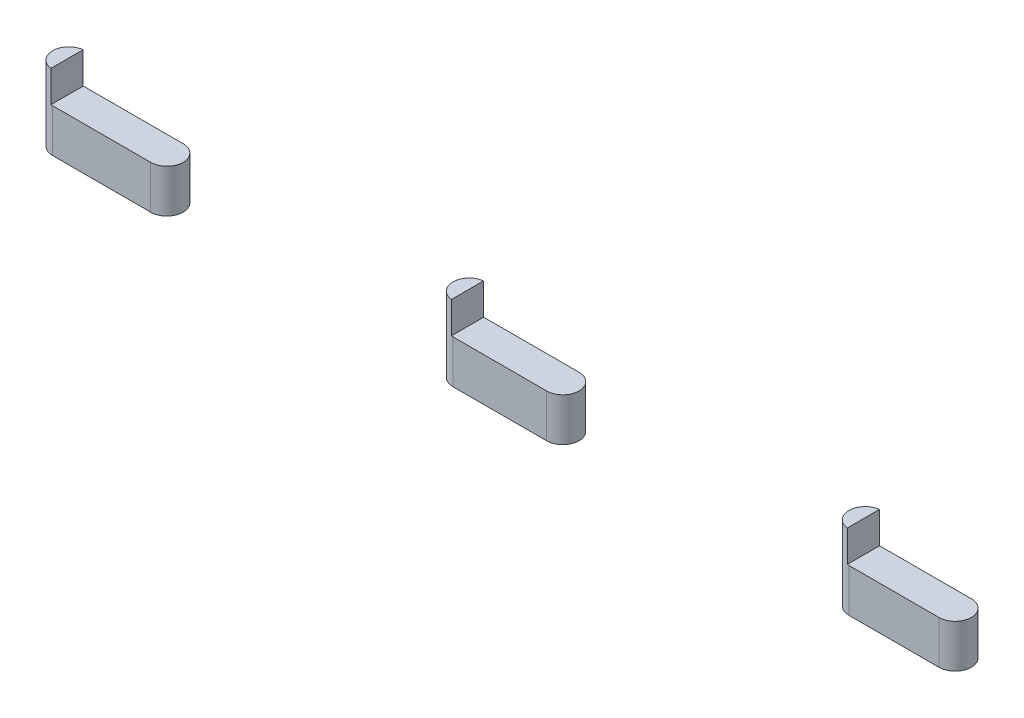
ISO-10303-21;
HEADER;
FILE_DESCRIPTION(('STEP AP214'),'2;1');
FILE_NAME('part.step','',(''),(''),'','','');
FILE_SCHEMA(('AUTOMOTIVE_DESIGN { 1 0 10303 214 1 1 1 1 }'));
ENDSEC;
DATA;
#1=APPLICATION_CONTEXT('core data for automotive mechanical design processes');
#2=APPLICATION_PROTOCOL_DEFINITION('international standard','automotive_design',2000,#1);
#3=PRODUCT_CONTEXT('',#1,'mechanical');
#4=PRODUCT('Part','Part','',(#3));
#5=PRODUCT_RELATED_PRODUCT_CATEGORY('part','',(#4));
#6=PRODUCT_DEFINITION_FORMATION('','',#4);
#7=PRODUCT_DEFINITION_CONTEXT('part definition',#1,'design');
#8=PRODUCT_DEFINITION('design','',#6,#7);
#9=PRODUCT_DEFINITION_SHAPE('','',#8);
#10=(LENGTH_UNIT() NAMED_UNIT(*) SI_UNIT(.MILLI.,.METRE.));
#11=(NAMED_UNIT(*) PLANE_ANGLE_UNIT() SI_UNIT($,.RADIAN.));
#12=(NAMED_UNIT(*) SI_UNIT($,.STERADIAN.) SOLID_ANGLE_UNIT());
#13=UNCERTAINTY_MEASURE_WITH_UNIT(LENGTH_MEASURE(1.E-05),#10,'distance_accuracy_value','');
#14=(GEOMETRIC_REPRESENTATION_CONTEXT(3) GLOBAL_UNCERTAINTY_ASSIGNED_CONTEXT((#13)) GLOBAL_UNIT_ASSIGNED_CONTEXT((#10,
#11,#12)) REPRESENTATION_CONTEXT('',''));
#15=CARTESIAN_POINT('',(0.,0.,0.));
#16=DIRECTION('',(0.,0.,1.));
#17=DIRECTION('',(1.,0.,0.));
#18=AXIS2_PLACEMENT_3D('',#15,#16,#17);
#19=CARTESIAN_POINT('',(48.8,0.,0.));
#20=DIRECTION('',(0.,-1.,0.));
#21=DIRECTION('',(0.,0.,-1.));
#22=AXIS2_PLACEMENT_3D('',#19,#20,#21);
#23=CYLINDRICAL_SURFACE('',#22,1.8);
#24=DIRECTION('',(0.,1.,0.));
#25=VECTOR('',#24,1.);
#26=CARTESIAN_POINT('',(48.8,0.,1.8));
#27=LINE('',#26,#25);
#28=CARTESIAN_POINT('',(48.8,0.,1.8));
#29=VERTEX_POINT('',#28);
#30=CARTESIAN_POINT('',(48.8,4.8,1.8));
#31=VERTEX_POINT('',#30);
#32=EDGE_CURVE('E113',#29,#31,#27,.T.);
#33=ORIENTED_EDGE('',*,*,#32,.F.);
#34=CARTESIAN_POINT('',(48.8,0.,0.));
#35=DIRECTION('',(0.,1.,0.));
#36=DIRECTION('',(0.,0.,1.));
#37=AXIS2_PLACEMENT_3D('',#34,#35,#36);
#38=CIRCLE('',#37,1.8);
#39=CARTESIAN_POINT('',(48.8,0.,-1.8));
#40=VERTEX_POINT('',#39);
#41=EDGE_CURVE('E58',#40,#29,#38,.F.);
#42=ORIENTED_EDGE('',*,*,#41,.F.);
#43=DIRECTION('',(0.,-1.,0.));
#44=VECTOR('',#43,1.);
#45=CARTESIAN_POINT('',(48.8,4.8,-1.8));
#46=LINE('',#45,#44);
#47=CARTESIAN_POINT('',(48.8,4.8,-1.8));
#48=VERTEX_POINT('',#47);
#49=EDGE_CURVE('E147',#48,#40,#46,.T.);
#50=ORIENTED_EDGE('',*,*,#49,.F.);
#51=CARTESIAN_POINT('',(48.8,4.8,0.));
#52=DIRECTION('',(0.,1.,0.));
#53=DIRECTION('',(0.,0.,1.));
#54=AXIS2_PLACEMENT_3D('',#51,#52,#53);
#55=CIRCLE('',#54,1.8);
#56=EDGE_CURVE('E12',#31,#48,#55,.T.);
#57=ORIENTED_EDGE('',*,*,#56,.F.);
#58=EDGE_LOOP('',(#33,#42,#50,#57));
#59=FACE_BOUND('',#58,.T.);
#60=ADVANCED_FACE('F50',(#59),#23,.T.);
#61=CARTESIAN_POINT('',(38.8,4.8,0.));
#62=DIRECTION('',(0.,-1.,0.));
#63=DIRECTION('',(0.,0.,-1.));
#64=AXIS2_PLACEMENT_3D('',#61,#62,#63);
#65=CYLINDRICAL_SURFACE('',#64,1.8);
#66=DIRECTION('',(0.,-1.,0.));
#67=VECTOR('',#66,1.);
#68=CARTESIAN_POINT('',(38.8,4.8,1.8));
#69=LINE('',#68,#67);
#70=CARTESIAN_POINT('',(38.8,4.8,1.8));
#71=VERTEX_POINT('',#70);
#72=CARTESIAN_POINT('',(38.8,0.,1.8));
#73=VERTEX_POINT('',#72);
#74=EDGE_CURVE('E105',#71,#73,#69,.T.);
#75=ORIENTED_EDGE('',*,*,#74,.F.);
#76=CARTESIAN_POINT('',(38.8,4.8,0.));
#77=DIRECTION('',(0.,1.,0.));
#78=DIRECTION('',(0.,0.,1.));
#79=AXIS2_PLACEMENT_3D('',#76,#77,#78);
#80=CIRCLE('',#79,1.8);
#81=CARTESIAN_POINT('',(38.6,4.8,1.78885438199983));
#82=VERTEX_POINT('',#81);
#83=EDGE_CURVE('E135',#82,#71,#80,.T.);
#84=ORIENTED_EDGE('',*,*,#83,.F.);
#85=DIRECTION('',(0.,-1.,0.));
#86=VECTOR('',#85,1.);
#87=CARTESIAN_POINT('',(38.6,4.8,1.78885438199983));
#88=LINE('',#87,#86);
#89=CARTESIAN_POINT('',(38.6,8.3,1.78885438199983));
#90=VERTEX_POINT('',#89);
#91=EDGE_CURVE('E140',#90,#82,#88,.T.);
#92=ORIENTED_EDGE('',*,*,#91,.F.);
#93=CARTESIAN_POINT('',(38.8,8.3,0.));
#94=DIRECTION('',(0.,1.,0.));
#95=DIRECTION('',(0.,0.,1.));
#96=AXIS2_PLACEMENT_3D('',#93,#94,#95);
#97=CIRCLE('',#96,1.8);
#98=CARTESIAN_POINT('',(38.6,8.3,-1.78885438199983));
#99=VERTEX_POINT('',#98);
#100=EDGE_CURVE('E114',#99,#90,#97,.T.);
#101=ORIENTED_EDGE('',*,*,#100,.F.);
#102=DIRECTION('',(0.,-1.,0.));
#103=VECTOR('',#102,1.);
#104=CARTESIAN_POINT('',(38.6,4.8,-1.78885438199983));
#105=LINE('',#104,#103);
#106=CARTESIAN_POINT('',(38.6,4.8,-1.78885438199983));
#107=VERTEX_POINT('',#106);
#108=EDGE_CURVE('E142',#107,#99,#105,.F.);
#109=ORIENTED_EDGE('',*,*,#108,.F.);
#110=CARTESIAN_POINT('',(38.8,4.8,0.));
#111=DIRECTION('',(0.,1.,0.));
#112=DIRECTION('',(0.,0.,1.));
#113=AXIS2_PLACEMENT_3D('',#110,#111,#112);
#114=CIRCLE('',#113,1.8);
#115=CARTESIAN_POINT('',(38.8,4.8,-1.8));
#116=VERTEX_POINT('',#115);
#117=EDGE_CURVE('E137',#116,#107,#114,.T.);
#118=ORIENTED_EDGE('',*,*,#117,.F.);
#119=DIRECTION('',(0.,1.,0.));
#120=VECTOR('',#119,1.);
#121=CARTESIAN_POINT('',(38.8,4.8,-1.8));
#122=LINE('',#121,#120);
#123=CARTESIAN_POINT('',(38.8,0.,-1.8));
#124=VERTEX_POINT('',#123);
#125=EDGE_CURVE('E108',#124,#116,#122,.T.);
#126=ORIENTED_EDGE('',*,*,#125,.F.);
#127=CARTESIAN_POINT('',(38.8,0.,0.));
#128=DIRECTION('',(0.,1.,0.));
#129=DIRECTION('',(0.,0.,1.));
#130=AXIS2_PLACEMENT_3D('',#127,#128,#129);
#131=CIRCLE('',#130,1.8);
#132=EDGE_CURVE('E101',#73,#124,#131,.F.);
#133=ORIENTED_EDGE('',*,*,#132,.F.);
#134=EDGE_LOOP('',(#75,#84,#92,#101,#109,#118,#126,#133));
#135=FACE_BOUND('',#134,.T.);
#136=ADVANCED_FACE('F103',(#135),#65,.T.);
#137=CARTESIAN_POINT('',(0.,4.8,-1.8));
#138=DIRECTION('',(0.,0.,-1.));
#139=DIRECTION('',(-1.,0.,0.));
#140=AXIS2_PLACEMENT_3D('',#137,#138,#139);
#141=PLANE('',#140);
#142=DIRECTION('',(1.,0.,0.));
#143=VECTOR('',#142,1.);
#144=CARTESIAN_POINT('',(0.,4.8,-1.8));
#145=LINE('',#144,#143);
#146=EDGE_CURVE('E124',#116,#48,#145,.T.);
#147=ORIENTED_EDGE('',*,*,#146,.T.);
#148=ORIENTED_EDGE('',*,*,#49,.T.);
#149=DIRECTION('',(1.,0.,0.));
#150=VECTOR('',#149,1.);
#151=CARTESIAN_POINT('',(0.,0.,-1.8));
#152=LINE('',#151,#150);
#153=EDGE_CURVE('E125',#124,#40,#152,.T.);
#154=ORIENTED_EDGE('',*,*,#153,.F.);
#155=ORIENTED_EDGE('',*,*,#125,.T.);
#156=EDGE_LOOP('',(#147,#148,#154,#155));
#157=FACE_BOUND('',#156,.T.);
#158=ADVANCED_FACE('F149',(#157),#141,.T.);
#159=CARTESIAN_POINT('',(0.,4.8,1.8));
#160=DIRECTION('',(0.,0.,-1.));
#161=DIRECTION('',(-1.,0.,0.));
#162=AXIS2_PLACEMENT_3D('',#159,#160,#161);
#163=PLANE('',#162);
#164=DIRECTION('',(1.,0.,0.));
#165=VECTOR('',#164,1.);
#166=CARTESIAN_POINT('',(0.,0.,1.8));
#167=LINE('',#166,#165);
#168=EDGE_CURVE('E120',#73,#29,#167,.T.);
#169=ORIENTED_EDGE('',*,*,#168,.T.);
#170=ORIENTED_EDGE('',*,*,#32,.T.);
#171=DIRECTION('',(1.,0.,0.));
#172=VECTOR('',#171,1.);
#173=CARTESIAN_POINT('',(0.,4.8,1.8));
#174=LINE('',#173,#172);
#175=EDGE_CURVE('E121',#71,#31,#174,.T.);
#176=ORIENTED_EDGE('',*,*,#175,.F.);
#177=ORIENTED_EDGE('',*,*,#74,.T.);
#178=EDGE_LOOP('',(#169,#170,#176,#177));
#179=FACE_BOUND('',#178,.T.);
#180=ADVANCED_FACE('F118',(#179),#163,.F.);
#181=CARTESIAN_POINT('',(0.,4.8,0.));
#182=DIRECTION('',(0.,1.,0.));
#183=DIRECTION('',(0.,0.,1.));
#184=AXIS2_PLACEMENT_3D('',#181,#182,#183);
#185=PLANE('',#184);
#186=ORIENTED_EDGE('',*,*,#175,.T.);
#187=ORIENTED_EDGE('',*,*,#56,.T.);
#188=ORIENTED_EDGE('',*,*,#146,.F.);
#189=ORIENTED_EDGE('',*,*,#117,.T.);
#190=DIRECTION('',(0.,0.,1.));
#191=VECTOR('',#190,1.);
#192=CARTESIAN_POINT('',(38.6,4.8,0.));
#193=LINE('',#192,#191);
#194=EDGE_CURVE('E128',#107,#82,#193,.T.);
#195=ORIENTED_EDGE('',*,*,#194,.T.);
#196=ORIENTED_EDGE('',*,*,#83,.T.);
#197=EDGE_LOOP('',(#186,#187,#188,#189,#195,#196));
#198=FACE_BOUND('',#197,.T.);
#199=ADVANCED_FACE('F150',(#198),#185,.T.);
#200=CARTESIAN_POINT('',(0.,0.,0.));
#201=DIRECTION('',(0.,1.,0.));
#202=DIRECTION('',(0.,0.,1.));
#203=AXIS2_PLACEMENT_3D('',#200,#201,#202);
#204=PLANE('',#203);
#205=ORIENTED_EDGE('',*,*,#153,.T.);
#206=ORIENTED_EDGE('',*,*,#41,.T.);
#207=ORIENTED_EDGE('',*,*,#168,.F.);
#208=ORIENTED_EDGE('',*,*,#132,.T.);
#209=EDGE_LOOP('',(#205,#206,#207,#208));
#210=FACE_BOUND('',#209,.T.);
#211=ADVANCED_FACE('F123',(#210),#204,.F.);
#212=CARTESIAN_POINT('',(38.6,8.3,0.));
#213=DIRECTION('',(1.,0.,0.));
#214=DIRECTION('',(0.,0.,-1.));
#215=AXIS2_PLACEMENT_3D('',#212,#213,#214);
#216=PLANE('',#215);
#217=ORIENTED_EDGE('',*,*,#194,.F.);
#218=ORIENTED_EDGE('',*,*,#108,.T.);
#219=DIRECTION('',(0.,0.,1.));
#220=VECTOR('',#219,1.);
#221=CARTESIAN_POINT('',(38.6,8.3,0.));
#222=LINE('',#221,#220);
#223=EDGE_CURVE('E130',#99,#90,#222,.T.);
#224=ORIENTED_EDGE('',*,*,#223,.T.);
#225=ORIENTED_EDGE('',*,*,#91,.T.);
#226=EDGE_LOOP('',(#217,#218,#224,#225));
#227=FACE_BOUND('',#226,.T.);
#228=ADVANCED_FACE('F158',(#227),#216,.T.);
#229=CARTESIAN_POINT('',(0.,8.3,0.));
#230=DIRECTION('',(0.,1.,0.));
#231=DIRECTION('',(0.,0.,1.));
#232=AXIS2_PLACEMENT_3D('',#229,#230,#231);
#233=PLANE('',#232);
#234=ORIENTED_EDGE('',*,*,#223,.F.);
#235=ORIENTED_EDGE('',*,*,#100,.T.);
#236=EDGE_LOOP('',(#234,#235));
#237=FACE_BOUND('',#236,.T.);
#238=ADVANCED_FACE('F161',(#237),#233,.T.);
#239=CLOSED_SHELL('',(#60,#136,#158,#180,#199,#211,#228,#238));
#240=MANIFOLD_SOLID_BREP('B2',#239);
#241=CARTESIAN_POINT('',(5.2,0.,0.));
#242=DIRECTION('',(0.,-1.,0.));
#243=DIRECTION('',(0.,0.,-1.));
#244=AXIS2_PLACEMENT_3D('',#241,#242,#243);
#245=CYLINDRICAL_SURFACE('',#244,1.8);
#246=DIRECTION('',(0.,1.,0.));
#247=VECTOR('',#246,1.);
#248=CARTESIAN_POINT('',(5.2,0.,1.8));
#249=LINE('',#248,#247);
#250=CARTESIAN_POINT('',(5.2,0.,1.8));
#251=VERTEX_POINT('',#250);
#252=CARTESIAN_POINT('',(5.2,4.8,1.8));
#253=VERTEX_POINT('',#252);
#254=EDGE_CURVE('E334',#251,#253,#249,.T.);
#255=ORIENTED_EDGE('',*,*,#254,.F.);
#256=CARTESIAN_POINT('',(5.2,0.,0.));
#257=DIRECTION('',(0.,1.,0.));
#258=DIRECTION('',(0.,0.,1.));
#259=AXIS2_PLACEMENT_3D('',#256,#257,#258);
#260=CIRCLE('',#259,1.8);
#261=CARTESIAN_POINT('',(5.2,0.,-1.8));
#262=VERTEX_POINT('',#261);
#263=EDGE_CURVE('E279',#262,#251,#260,.F.);
#264=ORIENTED_EDGE('',*,*,#263,.F.);
#265=DIRECTION('',(0.,-1.,0.));
#266=VECTOR('',#265,1.);
#267=CARTESIAN_POINT('',(5.2,4.8,-1.8));
#268=LINE('',#267,#266);
#269=CARTESIAN_POINT('',(5.2,4.8,-1.8));
#270=VERTEX_POINT('',#269);
#271=EDGE_CURVE('E368',#270,#262,#268,.T.);
#272=ORIENTED_EDGE('',*,*,#271,.F.);
#273=CARTESIAN_POINT('',(5.2,4.8,0.));
#274=DIRECTION('',(0.,1.,0.));
#275=DIRECTION('',(0.,0.,1.));
#276=AXIS2_PLACEMENT_3D('',#273,#274,#275);
#277=CIRCLE('',#276,1.8);
#278=EDGE_CURVE('E48',#253,#270,#277,.T.);
#279=ORIENTED_EDGE('',*,*,#278,.F.);
#280=EDGE_LOOP('',(#255,#264,#272,#279));
#281=FACE_BOUND('',#280,.T.);
#282=ADVANCED_FACE('F271',(#281),#245,.T.);
#283=CARTESIAN_POINT('',(-5.2,4.8,0.));
#284=DIRECTION('',(0.,-1.,0.));
#285=DIRECTION('',(0.,0.,-1.));
#286=AXIS2_PLACEMENT_3D('',#283,#284,#285);
#287=CYLINDRICAL_SURFACE('',#286,1.8);
#288=DIRECTION('',(0.,-1.,0.));
#289=VECTOR('',#288,1.);
#290=CARTESIAN_POINT('',(-5.2,4.8,1.8));
#291=LINE('',#290,#289);
#292=CARTESIAN_POINT('',(-5.2,4.8,1.8));
#293=VERTEX_POINT('',#292);
#294=CARTESIAN_POINT('',(-5.2,0.,1.8));
#295=VERTEX_POINT('',#294);
#296=EDGE_CURVE('E326',#293,#295,#291,.T.);
#297=ORIENTED_EDGE('',*,*,#296,.F.);
#298=CARTESIAN_POINT('',(-5.2,4.8,0.));
#299=DIRECTION('',(0.,1.,0.));
#300=DIRECTION('',(0.,0.,1.));
#301=AXIS2_PLACEMENT_3D('',#298,#299,#300);
#302=CIRCLE('',#301,1.8);
#303=CARTESIAN_POINT('',(-5.4,4.8,1.78885438199983));
#304=VERTEX_POINT('',#303);
#305=EDGE_CURVE('E356',#304,#293,#302,.T.);
#306=ORIENTED_EDGE('',*,*,#305,.F.);
#307=DIRECTION('',(0.,-1.,0.));
#308=VECTOR('',#307,1.);
#309=CARTESIAN_POINT('',(-5.4,4.8,1.78885438199983));
#310=LINE('',#309,#308);
#311=CARTESIAN_POINT('',(-5.4,8.3,1.78885438199983));
#312=VERTEX_POINT('',#311);
#313=EDGE_CURVE('E361',#312,#304,#310,.T.);
#314=ORIENTED_EDGE('',*,*,#313,.F.);
#315=CARTESIAN_POINT('',(-5.2,8.3,0.));
#316=DIRECTION('',(0.,1.,0.));
#317=DIRECTION('',(0.,0.,1.));
#318=AXIS2_PLACEMENT_3D('',#315,#316,#317);
#319=CIRCLE('',#318,1.8);
#320=CARTESIAN_POINT('',(-5.4,8.3,-1.78885438199983));
#321=VERTEX_POINT('',#320);
#322=EDGE_CURVE('E335',#321,#312,#319,.T.);
#323=ORIENTED_EDGE('',*,*,#322,.F.);
#324=DIRECTION('',(0.,-1.,0.));
#325=VECTOR('',#324,1.);
#326=CARTESIAN_POINT('',(-5.4,4.8,-1.78885438199983));
#327=LINE('',#326,#325);
#328=CARTESIAN_POINT('',(-5.4,4.8,-1.78885438199983));
#329=VERTEX_POINT('',#328);
#330=EDGE_CURVE('E363',#329,#321,#327,.F.);
#331=ORIENTED_EDGE('',*,*,#330,.F.);
#332=CARTESIAN_POINT('',(-5.2,4.8,0.));
#333=DIRECTION('',(0.,1.,0.));
#334=DIRECTION('',(0.,0.,1.));
#335=AXIS2_PLACEMENT_3D('',#332,#333,#334);
#336=CIRCLE('',#335,1.8);
#337=CARTESIAN_POINT('',(-5.2,4.8,-1.8));
#338=VERTEX_POINT('',#337);
#339=EDGE_CURVE('E358',#338,#329,#336,.T.);
#340=ORIENTED_EDGE('',*,*,#339,.F.);
#341=DIRECTION('',(0.,1.,0.));
#342=VECTOR('',#341,1.);
#343=CARTESIAN_POINT('',(-5.2,4.8,-1.8));
#344=LINE('',#343,#342);
#345=CARTESIAN_POINT('',(-5.2,0.,-1.8));
#346=VERTEX_POINT('',#345);
#347=EDGE_CURVE('E329',#346,#338,#344,.T.);
#348=ORIENTED_EDGE('',*,*,#347,.F.);
#349=CARTESIAN_POINT('',(-5.2,0.,0.));
#350=DIRECTION('',(0.,1.,0.));
#351=DIRECTION('',(0.,0.,1.));
#352=AXIS2_PLACEMENT_3D('',#349,#350,#351);
#353=CIRCLE('',#352,1.8);
#354=EDGE_CURVE('E322',#295,#346,#353,.F.);
#355=ORIENTED_EDGE('',*,*,#354,.F.);
#356=EDGE_LOOP('',(#297,#306,#314,#323,#331,#340,#348,#355));
#357=FACE_BOUND('',#356,.T.);
#358=ADVANCED_FACE('F324',(#357),#287,.T.);
#359=CARTESIAN_POINT('',(0.,4.8,-1.8));
#360=DIRECTION('',(0.,0.,-1.));
#361=DIRECTION('',(-1.,0.,0.));
#362=AXIS2_PLACEMENT_3D('',#359,#360,#361);
#363=PLANE('',#362);
#364=DIRECTION('',(1.,0.,0.));
#365=VECTOR('',#364,1.);
#366=CARTESIAN_POINT('',(0.,4.8,-1.8));
#367=LINE('',#366,#365);
#368=EDGE_CURVE('E345',#338,#270,#367,.T.);
#369=ORIENTED_EDGE('',*,*,#368,.T.);
#370=ORIENTED_EDGE('',*,*,#271,.T.);
#371=DIRECTION('',(1.,0.,0.));
#372=VECTOR('',#371,1.);
#373=CARTESIAN_POINT('',(0.,0.,-1.8));
#374=LINE('',#373,#372);
#375=EDGE_CURVE('E346',#346,#262,#374,.T.);
#376=ORIENTED_EDGE('',*,*,#375,.F.);
#377=ORIENTED_EDGE('',*,*,#347,.T.);
#378=EDGE_LOOP('',(#369,#370,#376,#377));
#379=FACE_BOUND('',#378,.T.);
#380=ADVANCED_FACE('F370',(#379),#363,.T.);
#381=CARTESIAN_POINT('',(0.,4.8,1.8));
#382=DIRECTION('',(0.,0.,-1.));
#383=DIRECTION('',(-1.,0.,0.));
#384=AXIS2_PLACEMENT_3D('',#381,#382,#383);
#385=PLANE('',#384);
#386=DIRECTION('',(1.,0.,0.));
#387=VECTOR('',#386,1.);
#388=CARTESIAN_POINT('',(0.,0.,1.8));
#389=LINE('',#388,#387);
#390=EDGE_CURVE('E341',#295,#251,#389,.T.);
#391=ORIENTED_EDGE('',*,*,#390,.T.);
#392=ORIENTED_EDGE('',*,*,#254,.T.);
#393=DIRECTION('',(1.,0.,0.));
#394=VECTOR('',#393,1.);
#395=CARTESIAN_POINT('',(0.,4.8,1.8));
#396=LINE('',#395,#394);
#397=EDGE_CURVE('E342',#293,#253,#396,.T.);
#398=ORIENTED_EDGE('',*,*,#397,.F.);
#399=ORIENTED_EDGE('',*,*,#296,.T.);
#400=EDGE_LOOP('',(#391,#392,#398,#399));
#401=FACE_BOUND('',#400,.T.);
#402=ADVANCED_FACE('F339',(#401),#385,.F.);
#403=CARTESIAN_POINT('',(0.,4.8,0.));
#404=DIRECTION('',(0.,1.,0.));
#405=DIRECTION('',(0.,0.,1.));
#406=AXIS2_PLACEMENT_3D('',#403,#404,#405);
#407=PLANE('',#406);
#408=ORIENTED_EDGE('',*,*,#397,.T.);
#409=ORIENTED_EDGE('',*,*,#278,.T.);
#410=ORIENTED_EDGE('',*,*,#368,.F.);
#411=ORIENTED_EDGE('',*,*,#339,.T.);
#412=DIRECTION('',(0.,0.,1.));
#413=VECTOR('',#412,1.);
#414=CARTESIAN_POINT('',(-5.4,4.8,0.));
#415=LINE('',#414,#413);
#416=EDGE_CURVE('E349',#329,#304,#415,.T.);
#417=ORIENTED_EDGE('',*,*,#416,.T.);
#418=ORIENTED_EDGE('',*,*,#305,.T.);
#419=EDGE_LOOP('',(#408,#409,#410,#411,#417,#418));
#420=FACE_BOUND('',#419,.T.);
#421=ADVANCED_FACE('F371',(#420),#407,.T.);
#422=CARTESIAN_POINT('',(0.,0.,0.));
#423=DIRECTION('',(0.,1.,0.));
#424=DIRECTION('',(0.,0.,1.));
#425=AXIS2_PLACEMENT_3D('',#422,#423,#424);
#426=PLANE('',#425);
#427=ORIENTED_EDGE('',*,*,#375,.T.);
#428=ORIENTED_EDGE('',*,*,#263,.T.);
#429=ORIENTED_EDGE('',*,*,#390,.F.);
#430=ORIENTED_EDGE('',*,*,#354,.T.);
#431=EDGE_LOOP('',(#427,#428,#429,#430));
#432=FACE_BOUND('',#431,.T.);
#433=ADVANCED_FACE('F344',(#432),#426,.F.);
#434=CARTESIAN_POINT('',(-5.4,8.3,0.));
#435=DIRECTION('',(1.,0.,0.));
#436=DIRECTION('',(0.,0.,-1.));
#437=AXIS2_PLACEMENT_3D('',#434,#435,#436);
#438=PLANE('',#437);
#439=ORIENTED_EDGE('',*,*,#416,.F.);
#440=ORIENTED_EDGE('',*,*,#330,.T.);
#441=DIRECTION('',(0.,0.,1.));
#442=VECTOR('',#441,1.);
#443=CARTESIAN_POINT('',(-5.4,8.3,0.));
#444=LINE('',#443,#442);
#445=EDGE_CURVE('E351',#321,#312,#444,.T.);
#446=ORIENTED_EDGE('',*,*,#445,.T.);
#447=ORIENTED_EDGE('',*,*,#313,.T.);
#448=EDGE_LOOP('',(#439,#440,#446,#447));
#449=FACE_BOUND('',#448,.T.);
#450=ADVANCED_FACE('F379',(#449),#438,.T.);
#451=CARTESIAN_POINT('',(0.,8.3,0.));
#452=DIRECTION('',(0.,1.,0.));
#453=DIRECTION('',(0.,0.,1.));
#454=AXIS2_PLACEMENT_3D('',#451,#452,#453);
#455=PLANE('',#454);
#456=ORIENTED_EDGE('',*,*,#445,.F.);
#457=ORIENTED_EDGE('',*,*,#322,.T.);
#458=EDGE_LOOP('',(#456,#457));
#459=FACE_BOUND('',#458,.T.);
#460=ADVANCED_FACE('F382',(#459),#455,.T.);
#461=CLOSED_SHELL('',(#282,#358,#380,#402,#421,#433,#450,#460));
#462=MANIFOLD_SOLID_BREP('B6',#461);
#463=CARTESIAN_POINT('',(-38.8,0.,0.));
#464=DIRECTION('',(0.,-1.,0.));
#465=DIRECTION('',(0.,0.,-1.));
#466=AXIS2_PLACEMENT_3D('',#463,#464,#465);
#467=CYLINDRICAL_SURFACE('',#466,1.8);
#468=DIRECTION('',(0.,-1.,0.));
#469=VECTOR('',#468,1.);
#470=CARTESIAN_POINT('',(-38.8,4.8,1.79999999999999));
#471=LINE('',#470,#469);
#472=CARTESIAN_POINT('',(-38.8,0.,1.79999999999999));
#473=VERTEX_POINT('',#472);
#474=CARTESIAN_POINT('',(-38.8,4.8,1.79999999999999));
#475=VERTEX_POINT('',#474);
#476=EDGE_CURVE('E553',#473,#475,#471,.F.);
#477=ORIENTED_EDGE('',*,*,#476,.F.);
#478=CARTESIAN_POINT('',(-38.8,0.,0.));
#479=DIRECTION('',(0.,1.,0.));
#480=DIRECTION('',(0.,0.,1.));
#481=AXIS2_PLACEMENT_3D('',#478,#479,#480);
#482=CIRCLE('',#481,1.8);
#483=CARTESIAN_POINT('',(-38.8,0.,-1.80000000000001));
#484=VERTEX_POINT('',#483);
#485=EDGE_CURVE('E491',#484,#473,#482,.F.);
#486=ORIENTED_EDGE('',*,*,#485,.F.);
#487=DIRECTION('',(0.,1.,0.));
#488=VECTOR('',#487,1.);
#489=CARTESIAN_POINT('',(-38.8,0.,-1.80000000000001));
#490=LINE('',#489,#488);
#491=CARTESIAN_POINT('',(-38.8,4.8,-1.80000000000001));
#492=VERTEX_POINT('',#491);
#493=EDGE_CURVE('E577',#492,#484,#490,.F.);
#494=ORIENTED_EDGE('',*,*,#493,.F.);
#495=CARTESIAN_POINT('',(-38.8,4.8,0.));
#496=DIRECTION('',(0.,1.,0.));
#497=DIRECTION('',(0.,0.,1.));
#498=AXIS2_PLACEMENT_3D('',#495,#496,#497);
#499=CIRCLE('',#498,1.8);
#500=EDGE_CURVE('E269',#475,#492,#499,.T.);
#501=ORIENTED_EDGE('',*,*,#500,.F.);
#502=EDGE_LOOP('',(#477,#486,#494,#501));
#503=FACE_BOUND('',#502,.T.);
#504=ADVANCED_FACE('F483',(#503),#467,.T.);
#505=CARTESIAN_POINT('',(-49.7,4.8,0.));
#506=DIRECTION('',(0.,-1.,0.));
#507=DIRECTION('',(0.,0.,-1.));
#508=AXIS2_PLACEMENT_3D('',#505,#506,#507);
#509=CYLINDRICAL_SURFACE('',#508,1.8);
#510=DIRECTION('',(0.,1.,0.));
#511=VECTOR('',#510,1.);
#512=CARTESIAN_POINT('',(-49.7,4.8,1.8));
#513=LINE('',#512,#511);
#514=CARTESIAN_POINT('',(-49.7,4.8,1.8));
#515=VERTEX_POINT('',#514);
#516=CARTESIAN_POINT('',(-49.7,0.,1.8));
#517=VERTEX_POINT('',#516);
#518=EDGE_CURVE('E549',#515,#517,#513,.F.);
#519=ORIENTED_EDGE('',*,*,#518,.F.);
#520=CARTESIAN_POINT('',(-49.7,4.8,0.));
#521=DIRECTION('',(0.,1.,0.));
#522=DIRECTION('',(0.,0.,1.));
#523=AXIS2_PLACEMENT_3D('',#520,#521,#522);
#524=CIRCLE('',#523,1.8);
#525=CARTESIAN_POINT('',(-49.9,4.8,1.78885438199983));
#526=VERTEX_POINT('',#525);
#527=EDGE_CURVE('E560',#526,#515,#524,.T.);
#528=ORIENTED_EDGE('',*,*,#527,.F.);
#529=DIRECTION('',(0.,-1.,0.));
#530=VECTOR('',#529,1.);
#531=CARTESIAN_POINT('',(-49.9,4.8,1.78885438199983));
#532=LINE('',#531,#530);
#533=CARTESIAN_POINT('',(-49.9,8.3,1.78885438199983));
#534=VERTEX_POINT('',#533);
#535=EDGE_CURVE('E570',#534,#526,#532,.T.);
#536=ORIENTED_EDGE('',*,*,#535,.F.);
#537=CARTESIAN_POINT('',(-49.7,8.3,0.));
#538=DIRECTION('',(0.,1.,0.));
#539=DIRECTION('',(0.,0.,1.));
#540=AXIS2_PLACEMENT_3D('',#537,#538,#539);
#541=CIRCLE('',#540,1.8);
#542=CARTESIAN_POINT('',(-49.9,8.3,-1.78885438199984));
#543=VERTEX_POINT('',#542);
#544=EDGE_CURVE('E554',#543,#534,#541,.T.);
#545=ORIENTED_EDGE('',*,*,#544,.F.);
#546=DIRECTION('',(0.,-1.,0.));
#547=VECTOR('',#546,1.);
#548=CARTESIAN_POINT('',(-49.9,4.8,-1.78885438199983));
#549=LINE('',#548,#547);
#550=CARTESIAN_POINT('',(-49.9,4.8,-1.78885438199983));
#551=VERTEX_POINT('',#550);
#552=EDGE_CURVE('E572',#551,#543,#549,.F.);
#553=ORIENTED_EDGE('',*,*,#552,.F.);
#554=CARTESIAN_POINT('',(-49.7,4.8,0.));
#555=DIRECTION('',(0.,1.,0.));
#556=DIRECTION('',(0.,0.,1.));
#557=AXIS2_PLACEMENT_3D('',#554,#555,#556);
#558=CIRCLE('',#557,1.8);
#559=CARTESIAN_POINT('',(-49.7,4.8,-1.8));
#560=VERTEX_POINT('',#559);
#561=EDGE_CURVE('E567',#560,#551,#558,.T.);
#562=ORIENTED_EDGE('',*,*,#561,.F.);
#563=DIRECTION('',(0.,-1.,0.));
#564=VECTOR('',#563,1.);
#565=CARTESIAN_POINT('',(-49.7,4.8,-1.8));
#566=LINE('',#565,#564);
#567=CARTESIAN_POINT('',(-49.7,0.,-1.8));
#568=VERTEX_POINT('',#567);
#569=EDGE_CURVE('E552',#568,#560,#566,.F.);
#570=ORIENTED_EDGE('',*,*,#569,.F.);
#571=CARTESIAN_POINT('',(-49.7,0.,0.));
#572=DIRECTION('',(0.,1.,0.));
#573=DIRECTION('',(0.,0.,1.));
#574=AXIS2_PLACEMENT_3D('',#571,#572,#573);
#575=CIRCLE('',#574,1.8);
#576=EDGE_CURVE('E537',#517,#568,#575,.F.);
#577=ORIENTED_EDGE('',*,*,#576,.F.);
#578=EDGE_LOOP('',(#519,#528,#536,#545,#553,#562,#570,#577));
#579=FACE_BOUND('',#578,.T.);
#580=ADVANCED_FACE('F547',(#579),#509,.T.);
#581=CARTESIAN_POINT('',(0.,4.8,-1.80000000000001));
#582=DIRECTION('',(0.,0.,1.));
#583=DIRECTION('',(1.,0.,0.));
#584=AXIS2_PLACEMENT_3D('',#581,#582,#583);
#585=PLANE('',#584);
#586=DIRECTION('',(-1.,0.,0.));
#587=VECTOR('',#586,1.);
#588=CARTESIAN_POINT('',(0.,4.8,-1.80000000000001));
#589=LINE('',#588,#587);
#590=EDGE_CURVE('E542',#492,#560,#589,.T.);
#591=ORIENTED_EDGE('',*,*,#590,.F.);
#592=ORIENTED_EDGE('',*,*,#493,.T.);
#593=DIRECTION('',(-1.,0.,0.));
#594=VECTOR('',#593,1.);
#595=CARTESIAN_POINT('',(0.,0.,-1.80000000000001));
#596=LINE('',#595,#594);
#597=EDGE_CURVE('E543',#484,#568,#596,.T.);
#598=ORIENTED_EDGE('',*,*,#597,.T.);
#599=ORIENTED_EDGE('',*,*,#569,.T.);
#600=EDGE_LOOP('',(#591,#592,#598,#599));
#601=FACE_BOUND('',#600,.T.);
#602=ADVANCED_FACE('F580',(#601),#585,.F.);
#603=CARTESIAN_POINT('',(0.,4.8,1.79999999999999));
#604=DIRECTION('',(0.,0.,1.));
#605=DIRECTION('',(1.,0.,0.));
#606=AXIS2_PLACEMENT_3D('',#603,#604,#605);
#607=PLANE('',#606);
#608=DIRECTION('',(-1.,0.,0.));
#609=VECTOR('',#608,1.);
#610=CARTESIAN_POINT('',(0.,0.,1.79999999999999));
#611=LINE('',#610,#609);
#612=EDGE_CURVE('E533',#473,#517,#611,.T.);
#613=ORIENTED_EDGE('',*,*,#612,.F.);
#614=ORIENTED_EDGE('',*,*,#476,.T.);
#615=DIRECTION('',(-1.,0.,0.));
#616=VECTOR('',#615,1.);
#617=CARTESIAN_POINT('',(0.,4.8,1.79999999999999));
#618=LINE('',#617,#616);
#619=EDGE_CURVE('E557',#475,#515,#618,.T.);
#620=ORIENTED_EDGE('',*,*,#619,.T.);
#621=ORIENTED_EDGE('',*,*,#518,.T.);
#622=EDGE_LOOP('',(#613,#614,#620,#621));
#623=FACE_BOUND('',#622,.T.);
#624=ADVANCED_FACE('F556',(#623),#607,.T.);
#625=CARTESIAN_POINT('',(0.,4.8,0.));
#626=DIRECTION('',(0.,1.,0.));
#627=DIRECTION('',(0.,0.,1.));
#628=AXIS2_PLACEMENT_3D('',#625,#626,#627);
#629=PLANE('',#628);
#630=ORIENTED_EDGE('',*,*,#619,.F.);
#631=ORIENTED_EDGE('',*,*,#500,.T.);
#632=ORIENTED_EDGE('',*,*,#590,.T.);
#633=ORIENTED_EDGE('',*,*,#561,.T.);
#634=DIRECTION('',(0.,0.,1.));
#635=VECTOR('',#634,1.);
#636=CARTESIAN_POINT('',(-49.9,4.8,0.));
#637=LINE('',#636,#635);
#638=EDGE_CURVE('E562',#551,#526,#637,.T.);
#639=ORIENTED_EDGE('',*,*,#638,.T.);
#640=ORIENTED_EDGE('',*,*,#527,.T.);
#641=EDGE_LOOP('',(#630,#631,#632,#633,#639,#640));
#642=FACE_BOUND('',#641,.T.);
#643=ADVANCED_FACE('F587',(#642),#629,.T.);
#644=CARTESIAN_POINT('',(0.,0.,0.));
#645=DIRECTION('',(0.,1.,0.));
#646=DIRECTION('',(0.,0.,1.));
#647=AXIS2_PLACEMENT_3D('',#644,#645,#646);
#648=PLANE('',#647);
#649=ORIENTED_EDGE('',*,*,#597,.F.);
#650=ORIENTED_EDGE('',*,*,#485,.T.);
#651=ORIENTED_EDGE('',*,*,#612,.T.);
#652=ORIENTED_EDGE('',*,*,#576,.T.);
#653=EDGE_LOOP('',(#649,#650,#651,#652));
#654=FACE_BOUND('',#653,.T.);
#655=ADVANCED_FACE('F536',(#654),#648,.F.);
#656=CARTESIAN_POINT('',(-49.9,8.3,0.));
#657=DIRECTION('',(1.,0.,0.));
#658=DIRECTION('',(0.,0.,-1.));
#659=AXIS2_PLACEMENT_3D('',#656,#657,#658);
#660=PLANE('',#659);
#661=ORIENTED_EDGE('',*,*,#638,.F.);
#662=ORIENTED_EDGE('',*,*,#552,.T.);
#663=DIRECTION('',(0.,0.,1.));
#664=VECTOR('',#663,1.);
#665=CARTESIAN_POINT('',(-49.9,8.3,0.));
#666=LINE('',#665,#664);
#667=EDGE_CURVE('E581',#543,#534,#666,.T.);
#668=ORIENTED_EDGE('',*,*,#667,.T.);
#669=ORIENTED_EDGE('',*,*,#535,.T.);
#670=EDGE_LOOP('',(#661,#662,#668,#669));
#671=FACE_BOUND('',#670,.T.);
#672=ADVANCED_FACE('F592',(#671),#660,.T.);
#673=CARTESIAN_POINT('',(0.,8.3,0.));
#674=DIRECTION('',(0.,1.,0.));
#675=DIRECTION('',(0.,0.,1.));
#676=AXIS2_PLACEMENT_3D('',#673,#674,#675);
#677=PLANE('',#676);
#678=ORIENTED_EDGE('',*,*,#667,.F.);
#679=ORIENTED_EDGE('',*,*,#544,.T.);
#680=EDGE_LOOP('',(#678,#679));
#681=FACE_BOUND('',#680,.T.);
#682=ADVANCED_FACE('F594',(#681),#677,.T.);
#683=CLOSED_SHELL('',(#504,#580,#602,#624,#643,#655,#672,#682));
#684=MANIFOLD_SOLID_BREP('B42',#683);
#685=ADVANCED_BREP_SHAPE_REPRESENTATION('',(#18,#240,#462,#684),#14);
#686=SHAPE_DEFINITION_REPRESENTATION(#9,#685);
ENDSEC;
END-ISO-10303-21;
